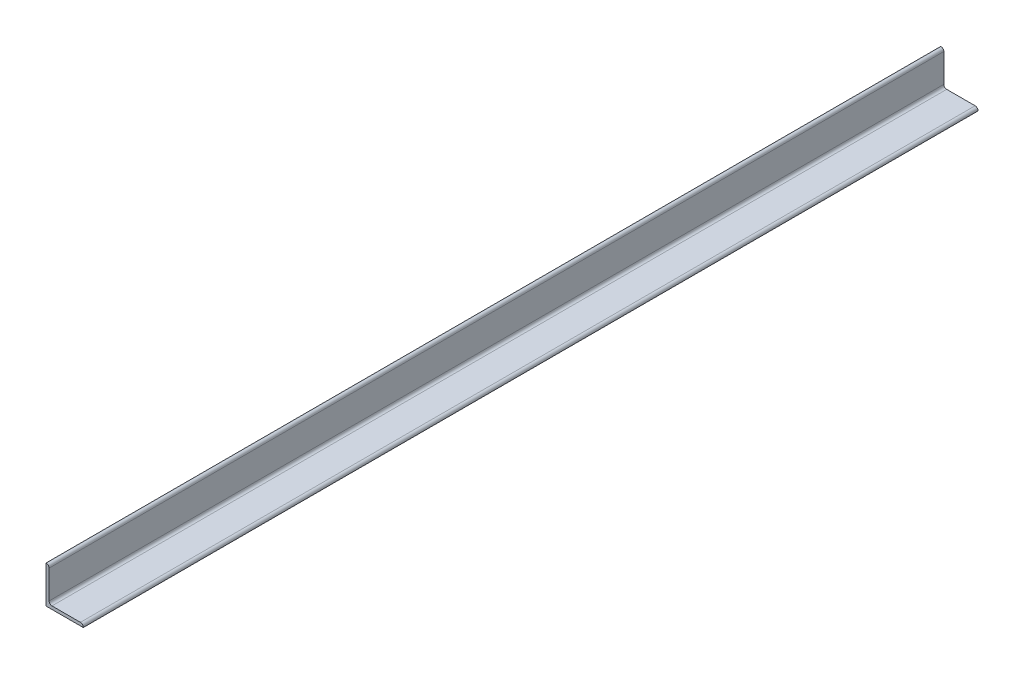
ISO-10303-21;
HEADER;
FILE_DESCRIPTION(('STEP AP214'),'2;1');
FILE_NAME('part.step','',(''),(''),'','','');
FILE_SCHEMA(('AUTOMOTIVE_DESIGN { 1 0 10303 214 1 1 1 1 }'));
ENDSEC;
DATA;
#1=APPLICATION_CONTEXT('core data for automotive mechanical design processes');
#2=APPLICATION_PROTOCOL_DEFINITION('international standard','automotive_design',2000,#1);
#3=PRODUCT_CONTEXT('',#1,'mechanical');
#4=PRODUCT('Part','Part','',(#3));
#5=PRODUCT_RELATED_PRODUCT_CATEGORY('part','',(#4));
#6=PRODUCT_DEFINITION_FORMATION('','',#4);
#7=PRODUCT_DEFINITION_CONTEXT('part definition',#1,'design');
#8=PRODUCT_DEFINITION('design','',#6,#7);
#9=PRODUCT_DEFINITION_SHAPE('','',#8);
#10=(LENGTH_UNIT() NAMED_UNIT(*) SI_UNIT(.MILLI.,.METRE.));
#11=(NAMED_UNIT(*) PLANE_ANGLE_UNIT() SI_UNIT($,.RADIAN.));
#12=(NAMED_UNIT(*) SI_UNIT($,.STERADIAN.) SOLID_ANGLE_UNIT());
#13=UNCERTAINTY_MEASURE_WITH_UNIT(LENGTH_MEASURE(1.E-05),#10,'distance_accuracy_value','');
#14=(GEOMETRIC_REPRESENTATION_CONTEXT(3) GLOBAL_UNCERTAINTY_ASSIGNED_CONTEXT((#13)) GLOBAL_UNIT_ASSIGNED_CONTEXT((#10,
#11,#12)) REPRESENTATION_CONTEXT('',''));
#15=CARTESIAN_POINT('',(0.,0.,0.));
#16=DIRECTION('',(0.,0.,1.));
#17=DIRECTION('',(1.,0.,0.));
#18=AXIS2_PLACEMENT_3D('',#15,#16,#17);
#19=CARTESIAN_POINT('',(6.35,76.2,0.));
#20=DIRECTION('',(0.,1.,0.));
#21=DIRECTION('',(0.,0.,1.));
#22=AXIS2_PLACEMENT_3D('',#19,#20,#21);
#23=PLANE('',#22);
#24=DIRECTION('',(1.,0.,0.));
#25=VECTOR('',#24,1.);
#26=CARTESIAN_POINT('',(0.,76.2,1828.8));
#27=LINE('',#26,#25);
#28=CARTESIAN_POINT('',(0.508,76.2,1828.8));
#29=VERTEX_POINT('',#28);
#30=CARTESIAN_POINT('',(0.,76.2,1828.8));
#31=VERTEX_POINT('',#30);
#32=EDGE_CURVE('E115',#29,#31,#27,.F.);
#33=ORIENTED_EDGE('',*,*,#32,.F.);
#34=DIRECTION('',(0.,0.,-1.));
#35=VECTOR('',#34,1.);
#36=CARTESIAN_POINT('',(0.508,76.2,4212.82368));
#37=LINE('',#36,#35);
#38=CARTESIAN_POINT('',(0.508,76.2,0.));
#39=VERTEX_POINT('',#38);
#40=EDGE_CURVE('E100',#39,#29,#37,.F.);
#41=ORIENTED_EDGE('',*,*,#40,.F.);
#42=DIRECTION('',(1.,0.,0.));
#43=VECTOR('',#42,1.);
#44=CARTESIAN_POINT('',(6.35,76.2,0.));
#45=LINE('',#44,#43);
#46=CARTESIAN_POINT('',(0.,76.2,0.));
#47=VERTEX_POINT('',#46);
#48=EDGE_CURVE('E142',#39,#47,#45,.F.);
#49=ORIENTED_EDGE('',*,*,#48,.T.);
#50=DIRECTION('',(0.,0.,1.));
#51=VECTOR('',#50,1.);
#52=CARTESIAN_POINT('',(0.,76.2,0.));
#53=LINE('',#52,#51);
#54=EDGE_CURVE('E147',#31,#47,#53,.F.);
#55=ORIENTED_EDGE('',*,*,#54,.F.);
#56=EDGE_LOOP('',(#33,#41,#49,#55));
#57=FACE_BOUND('',#56,.T.);
#58=ADVANCED_FACE('F17',(#57),#23,.T.);
#59=CARTESIAN_POINT('',(0.508,70.358,4212.82368));
#60=DIRECTION('',(0.,0.,-1.));
#61=DIRECTION('',(-1.,0.,0.));
#62=AXIS2_PLACEMENT_3D('',#59,#60,#61);
#63=CYLINDRICAL_SURFACE('',#62,5.842);
#64=DIRECTION('',(0.,0.,-1.));
#65=VECTOR('',#64,1.);
#66=CARTESIAN_POINT('',(6.35,70.358,0.));
#67=LINE('',#66,#65);
#68=CARTESIAN_POINT('',(6.35,70.358,0.));
#69=VERTEX_POINT('',#68);
#70=CARTESIAN_POINT('',(6.35,70.358,1828.8));
#71=VERTEX_POINT('',#70);
#72=EDGE_CURVE('E127',#69,#71,#67,.F.);
#73=ORIENTED_EDGE('',*,*,#72,.F.);
#74=CARTESIAN_POINT('',(0.508,70.358,0.));
#75=DIRECTION('',(0.,0.,-1.));
#76=DIRECTION('',(-1.,0.,0.));
#77=AXIS2_PLACEMENT_3D('',#74,#75,#76);
#78=CIRCLE('',#77,5.842);
#79=EDGE_CURVE('E149',#69,#39,#78,.F.);
#80=ORIENTED_EDGE('',*,*,#79,.T.);
#81=ORIENTED_EDGE('',*,*,#40,.T.);
#82=CARTESIAN_POINT('',(0.508,70.358,1828.8));
#83=DIRECTION('',(0.,0.,-1.));
#84=DIRECTION('',(-1.,0.,0.));
#85=AXIS2_PLACEMENT_3D('',#82,#83,#84);
#86=CIRCLE('',#85,5.842);
#87=EDGE_CURVE('E155',#71,#29,#86,.F.);
#88=ORIENTED_EDGE('',*,*,#87,.F.);
#89=EDGE_LOOP('',(#73,#80,#81,#88));
#90=FACE_BOUND('',#89,.T.);
#91=ADVANCED_FACE('F275',(#90),#63,.T.);
#92=CARTESIAN_POINT('',(70.358,0.508,4212.82368));
#93=DIRECTION('',(0.,0.,-1.));
#94=DIRECTION('',(-1.,0.,0.));
#95=AXIS2_PLACEMENT_3D('',#92,#93,#94);
#96=CYLINDRICAL_SURFACE('',#95,5.842);
#97=DIRECTION('',(0.,0.,-1.));
#98=VECTOR('',#97,1.);
#99=CARTESIAN_POINT('',(76.2,0.508,0.));
#100=LINE('',#99,#98);
#101=CARTESIAN_POINT('',(76.2,0.508,0.));
#102=VERTEX_POINT('',#101);
#103=CARTESIAN_POINT('',(76.2,0.508,1828.8));
#104=VERTEX_POINT('',#103);
#105=EDGE_CURVE('E85',#102,#104,#100,.F.);
#106=ORIENTED_EDGE('',*,*,#105,.F.);
#107=CARTESIAN_POINT('',(70.358,0.508,0.));
#108=DIRECTION('',(0.,0.,-1.));
#109=DIRECTION('',(-1.,0.,0.));
#110=AXIS2_PLACEMENT_3D('',#107,#108,#109);
#111=CIRCLE('',#110,5.842);
#112=CARTESIAN_POINT('',(70.358,6.35,0.));
#113=VERTEX_POINT('',#112);
#114=EDGE_CURVE('E96',#102,#113,#111,.F.);
#115=ORIENTED_EDGE('',*,*,#114,.T.);
#116=DIRECTION('',(0.,0.,1.));
#117=VECTOR('',#116,1.);
#118=CARTESIAN_POINT('',(70.358,6.35,0.));
#119=LINE('',#118,#117);
#120=CARTESIAN_POINT('',(70.358,6.35,1828.8));
#121=VERTEX_POINT('',#120);
#122=EDGE_CURVE('E90',#121,#113,#119,.F.);
#123=ORIENTED_EDGE('',*,*,#122,.F.);
#124=CARTESIAN_POINT('',(70.358,0.508,1828.8));
#125=DIRECTION('',(0.,0.,-1.));
#126=DIRECTION('',(-1.,0.,0.));
#127=AXIS2_PLACEMENT_3D('',#124,#125,#126);
#128=CIRCLE('',#127,5.842);
#129=EDGE_CURVE('E20',#104,#121,#128,.F.);
#130=ORIENTED_EDGE('',*,*,#129,.F.);
#131=EDGE_LOOP('',(#106,#115,#123,#130));
#132=FACE_BOUND('',#131,.T.);
#133=ADVANCED_FACE('F92',(#132),#96,.T.);
#134=CARTESIAN_POINT('',(76.2,6.35,0.));
#135=DIRECTION('',(0.,1.,0.));
#136=DIRECTION('',(0.,0.,1.));
#137=AXIS2_PLACEMENT_3D('',#134,#135,#136);
#138=PLANE('',#137);
#139=DIRECTION('',(1.,0.,0.));
#140=VECTOR('',#139,1.);
#141=CARTESIAN_POINT('',(0.,6.35,1828.8));
#142=LINE('',#141,#140);
#143=CARTESIAN_POINT('',(12.192,6.35,1828.8));
#144=VERTEX_POINT('',#143);
#145=EDGE_CURVE('E103',#121,#144,#142,.F.);
#146=ORIENTED_EDGE('',*,*,#145,.F.);
#147=ORIENTED_EDGE('',*,*,#122,.T.);
#148=DIRECTION('',(1.,0.,0.));
#149=VECTOR('',#148,1.);
#150=CARTESIAN_POINT('',(0.,6.35,0.));
#151=LINE('',#150,#149);
#152=CARTESIAN_POINT('',(12.192,6.35,0.));
#153=VERTEX_POINT('',#152);
#154=EDGE_CURVE('E167',#113,#153,#151,.F.);
#155=ORIENTED_EDGE('',*,*,#154,.T.);
#156=DIRECTION('',(0.,0.,1.));
#157=VECTOR('',#156,1.);
#158=CARTESIAN_POINT('',(12.192,6.35,-2384.02368));
#159=LINE('',#158,#157);
#160=EDGE_CURVE('E99',#153,#144,#159,.T.);
#161=ORIENTED_EDGE('',*,*,#160,.T.);
#162=EDGE_LOOP('',(#146,#147,#155,#161));
#163=FACE_BOUND('',#162,.T.);
#164=ADVANCED_FACE('F104',(#163),#138,.T.);
#165=CARTESIAN_POINT('',(12.192,12.192,-2384.02368));
#166=DIRECTION('',(0.,0.,1.));
#167=DIRECTION('',(1.,0.,0.));
#168=AXIS2_PLACEMENT_3D('',#165,#166,#167);
#169=CYLINDRICAL_SURFACE('',#168,5.842);
#170=ORIENTED_EDGE('',*,*,#160,.F.);
#171=CARTESIAN_POINT('',(12.192,12.192,0.));
#172=DIRECTION('',(0.,0.,1.));
#173=DIRECTION('',(1.,0.,0.));
#174=AXIS2_PLACEMENT_3D('',#171,#172,#173);
#175=CIRCLE('',#174,5.842);
#176=CARTESIAN_POINT('',(6.35,12.192,0.));
#177=VERTEX_POINT('',#176);
#178=EDGE_CURVE('E165',#153,#177,#175,.F.);
#179=ORIENTED_EDGE('',*,*,#178,.T.);
#180=DIRECTION('',(0.,0.,-1.));
#181=VECTOR('',#180,1.);
#182=CARTESIAN_POINT('',(6.35,12.192,0.));
#183=LINE('',#182,#181);
#184=CARTESIAN_POINT('',(6.35,12.192,1828.8));
#185=VERTEX_POINT('',#184);
#186=EDGE_CURVE('E124',#185,#177,#183,.T.);
#187=ORIENTED_EDGE('',*,*,#186,.F.);
#188=CARTESIAN_POINT('',(12.192,12.192,1828.8));
#189=DIRECTION('',(0.,0.,1.));
#190=DIRECTION('',(1.,0.,0.));
#191=AXIS2_PLACEMENT_3D('',#188,#189,#190);
#192=CIRCLE('',#191,5.842);
#193=EDGE_CURVE('E109',#144,#185,#192,.F.);
#194=ORIENTED_EDGE('',*,*,#193,.F.);
#195=EDGE_LOOP('',(#170,#179,#187,#194));
#196=FACE_BOUND('',#195,.T.);
#197=ADVANCED_FACE('F205',(#196),#169,.F.);
#198=CARTESIAN_POINT('',(6.35,6.35,0.));
#199=DIRECTION('',(1.,0.,0.));
#200=DIRECTION('',(0.,0.,-1.));
#201=AXIS2_PLACEMENT_3D('',#198,#199,#200);
#202=PLANE('',#201);
#203=DIRECTION('',(0.,1.,0.));
#204=VECTOR('',#203,1.);
#205=CARTESIAN_POINT('',(6.35,0.,0.));
#206=LINE('',#205,#204);
#207=EDGE_CURVE('E135',#177,#69,#206,.T.);
#208=ORIENTED_EDGE('',*,*,#207,.T.);
#209=ORIENTED_EDGE('',*,*,#72,.T.);
#210=DIRECTION('',(0.,1.,0.));
#211=VECTOR('',#210,1.);
#212=CARTESIAN_POINT('',(6.35,0.,1828.8));
#213=LINE('',#212,#211);
#214=EDGE_CURVE('E172',#185,#71,#213,.T.);
#215=ORIENTED_EDGE('',*,*,#214,.F.);
#216=ORIENTED_EDGE('',*,*,#186,.T.);
#217=EDGE_LOOP('',(#208,#209,#215,#216));
#218=FACE_BOUND('',#217,.T.);
#219=ADVANCED_FACE('F197',(#218),#202,.T.);
#220=CARTESIAN_POINT('',(76.2,0.,0.));
#221=DIRECTION('',(1.,0.,0.));
#222=DIRECTION('',(0.,0.,-1.));
#223=AXIS2_PLACEMENT_3D('',#220,#221,#222);
#224=PLANE('',#223);
#225=DIRECTION('',(0.,1.,0.));
#226=VECTOR('',#225,1.);
#227=CARTESIAN_POINT('',(76.2,0.,0.));
#228=LINE('',#227,#226);
#229=CARTESIAN_POINT('',(76.2,0.,0.));
#230=VERTEX_POINT('',#229);
#231=EDGE_CURVE('E162',#230,#102,#228,.T.);
#232=ORIENTED_EDGE('',*,*,#231,.T.);
#233=ORIENTED_EDGE('',*,*,#105,.T.);
#234=DIRECTION('',(0.,1.,0.));
#235=VECTOR('',#234,1.);
#236=CARTESIAN_POINT('',(76.2,0.,1828.8));
#237=LINE('',#236,#235);
#238=CARTESIAN_POINT('',(76.2,0.,1828.8));
#239=VERTEX_POINT('',#238);
#240=EDGE_CURVE('E114',#239,#104,#237,.T.);
#241=ORIENTED_EDGE('',*,*,#240,.F.);
#242=DIRECTION('',(0.,0.,-1.));
#243=VECTOR('',#242,1.);
#244=CARTESIAN_POINT('',(76.2,0.,0.));
#245=LINE('',#244,#243);
#246=EDGE_CURVE('E131',#230,#239,#245,.F.);
#247=ORIENTED_EDGE('',*,*,#246,.F.);
#248=EDGE_LOOP('',(#232,#233,#241,#247));
#249=FACE_BOUND('',#248,.T.);
#250=ADVANCED_FACE('F195',(#249),#224,.T.);
#251=CARTESIAN_POINT('',(0.,0.,1828.8));
#252=DIRECTION('',(0.,0.,1.));
#253=DIRECTION('',(1.,0.,0.));
#254=AXIS2_PLACEMENT_3D('',#251,#252,#253);
#255=PLANE('',#254);
#256=ORIENTED_EDGE('',*,*,#214,.T.);
#257=ORIENTED_EDGE('',*,*,#87,.T.);
#258=ORIENTED_EDGE('',*,*,#32,.T.);
#259=DIRECTION('',(0.,1.,0.));
#260=VECTOR('',#259,1.);
#261=CARTESIAN_POINT('',(0.,76.2,1828.8));
#262=LINE('',#261,#260);
#263=CARTESIAN_POINT('',(0.,0.,1828.8));
#264=VERTEX_POINT('',#263);
#265=EDGE_CURVE('E150',#264,#31,#262,.T.);
#266=ORIENTED_EDGE('',*,*,#265,.F.);
#267=DIRECTION('',(1.,0.,0.));
#268=VECTOR('',#267,1.);
#269=CARTESIAN_POINT('',(0.,0.,1828.8));
#270=LINE('',#269,#268);
#271=EDGE_CURVE('E134',#239,#264,#270,.F.);
#272=ORIENTED_EDGE('',*,*,#271,.F.);
#273=ORIENTED_EDGE('',*,*,#240,.T.);
#274=ORIENTED_EDGE('',*,*,#129,.T.);
#275=ORIENTED_EDGE('',*,*,#145,.T.);
#276=ORIENTED_EDGE('',*,*,#193,.T.);
#277=EDGE_LOOP('',(#256,#257,#258,#266,#272,#273,#274,#275,#276));
#278=FACE_BOUND('',#277,.T.);
#279=ADVANCED_FACE('F112',(#278),#255,.T.);
#280=CARTESIAN_POINT('',(0.,76.2,0.));
#281=DIRECTION('',(-1.,0.,0.));
#282=DIRECTION('',(0.,0.,1.));
#283=AXIS2_PLACEMENT_3D('',#280,#281,#282);
#284=PLANE('',#283);
#285=ORIENTED_EDGE('',*,*,#54,.T.);
#286=DIRECTION('',(0.,1.,0.));
#287=VECTOR('',#286,1.);
#288=CARTESIAN_POINT('',(0.,0.,0.));
#289=LINE('',#288,#287);
#290=CARTESIAN_POINT('',(0.,0.,0.));
#291=VERTEX_POINT('',#290);
#292=EDGE_CURVE('E35',#47,#291,#289,.F.);
#293=ORIENTED_EDGE('',*,*,#292,.T.);
#294=DIRECTION('',(0.,0.,-1.));
#295=VECTOR('',#294,1.);
#296=CARTESIAN_POINT('',(0.,0.,0.));
#297=LINE('',#296,#295);
#298=EDGE_CURVE('E26',#264,#291,#297,.T.);
#299=ORIENTED_EDGE('',*,*,#298,.F.);
#300=ORIENTED_EDGE('',*,*,#265,.T.);
#301=EDGE_LOOP('',(#285,#293,#299,#300));
#302=FACE_BOUND('',#301,.T.);
#303=ADVANCED_FACE('F184',(#302),#284,.T.);
#304=CARTESIAN_POINT('',(0.,0.,0.));
#305=DIRECTION('',(0.,0.,1.));
#306=DIRECTION('',(1.,0.,0.));
#307=AXIS2_PLACEMENT_3D('',#304,#305,#306);
#308=PLANE('',#307);
#309=ORIENTED_EDGE('',*,*,#178,.F.);
#310=ORIENTED_EDGE('',*,*,#154,.F.);
#311=ORIENTED_EDGE('',*,*,#114,.F.);
#312=ORIENTED_EDGE('',*,*,#231,.F.);
#313=DIRECTION('',(1.,0.,0.));
#314=VECTOR('',#313,1.);
#315=CARTESIAN_POINT('',(0.,0.,0.));
#316=LINE('',#315,#314);
#317=EDGE_CURVE('E11',#291,#230,#316,.T.);
#318=ORIENTED_EDGE('',*,*,#317,.F.);
#319=ORIENTED_EDGE('',*,*,#292,.F.);
#320=ORIENTED_EDGE('',*,*,#48,.F.);
#321=ORIENTED_EDGE('',*,*,#79,.F.);
#322=ORIENTED_EDGE('',*,*,#207,.F.);
#323=EDGE_LOOP('',(#309,#310,#311,#312,#318,#319,#320,#321,#322));
#324=FACE_BOUND('',#323,.T.);
#325=ADVANCED_FACE('F192',(#324),#308,.F.);
#326=CARTESIAN_POINT('',(0.,0.,0.));
#327=DIRECTION('',(0.,-1.,0.));
#328=DIRECTION('',(0.,0.,-1.));
#329=AXIS2_PLACEMENT_3D('',#326,#327,#328);
#330=PLANE('',#329);
#331=ORIENTED_EDGE('',*,*,#298,.T.);
#332=ORIENTED_EDGE('',*,*,#317,.T.);
#333=ORIENTED_EDGE('',*,*,#246,.T.);
#334=ORIENTED_EDGE('',*,*,#271,.T.);
#335=EDGE_LOOP('',(#331,#332,#333,#334));
#336=FACE_BOUND('',#335,.T.);
#337=ADVANCED_FACE('F183',(#336),#330,.T.);
#338=CLOSED_SHELL('',(#58,#91,#133,#164,#197,#219,#250,#279,#303,#325,#337));
#339=MANIFOLD_SOLID_BREP('B1',#338);
#340=ADVANCED_BREP_SHAPE_REPRESENTATION('',(#18,#339),#14);
#341=SHAPE_DEFINITION_REPRESENTATION(#9,#340);
ENDSEC;
END-ISO-10303-21;
